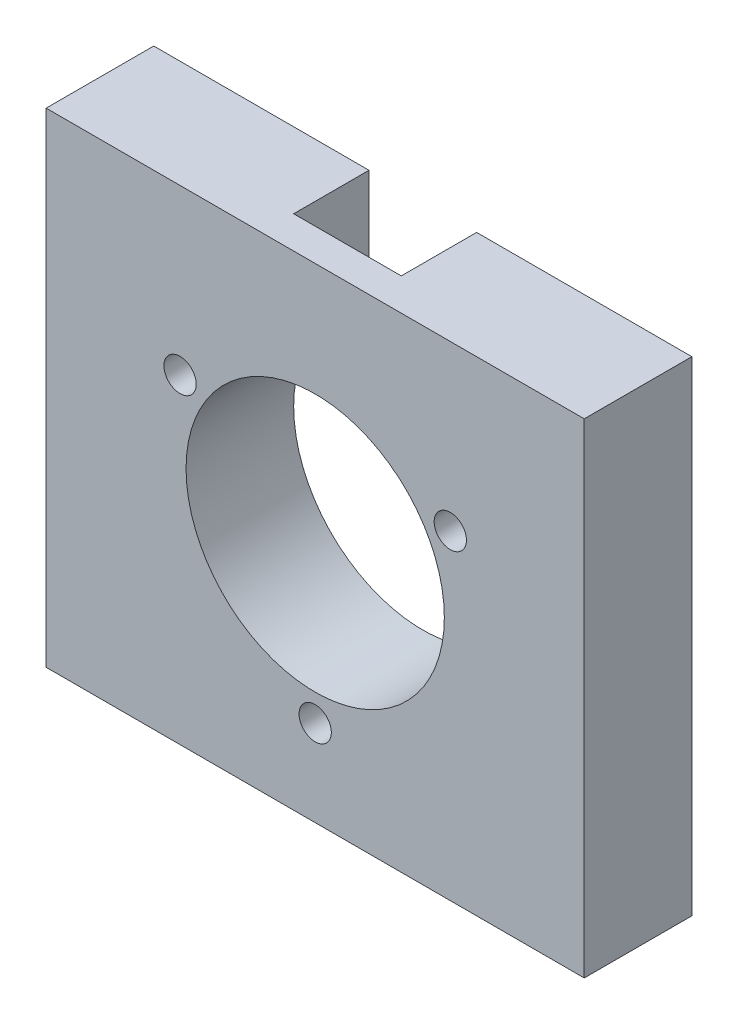
ISO-10303-21;
HEADER;
FILE_DESCRIPTION(('STEP AP214'),'2;1');
FILE_NAME('part.step','',(''),(''),'','','');
FILE_SCHEMA(('AUTOMOTIVE_DESIGN { 1 0 10303 214 1 1 1 1 }'));
ENDSEC;
DATA;
#1=APPLICATION_CONTEXT('core data for automotive mechanical design processes');
#2=APPLICATION_PROTOCOL_DEFINITION('international standard','automotive_design',2000,#1);
#3=PRODUCT_CONTEXT('',#1,'mechanical');
#4=PRODUCT('Part','Part','',(#3));
#5=PRODUCT_RELATED_PRODUCT_CATEGORY('part','',(#4));
#6=PRODUCT_DEFINITION_FORMATION('','',#4);
#7=PRODUCT_DEFINITION_CONTEXT('part definition',#1,'design');
#8=PRODUCT_DEFINITION('design','',#6,#7);
#9=PRODUCT_DEFINITION_SHAPE('','',#8);
#10=(LENGTH_UNIT() NAMED_UNIT(*) SI_UNIT(.MILLI.,.METRE.));
#11=(NAMED_UNIT(*) PLANE_ANGLE_UNIT() SI_UNIT($,.RADIAN.));
#12=(NAMED_UNIT(*) SI_UNIT($,.STERADIAN.) SOLID_ANGLE_UNIT());
#13=UNCERTAINTY_MEASURE_WITH_UNIT(LENGTH_MEASURE(1.E-05),#10,'distance_accuracy_value','');
#14=(GEOMETRIC_REPRESENTATION_CONTEXT(3) GLOBAL_UNCERTAINTY_ASSIGNED_CONTEXT((#13)) GLOBAL_UNIT_ASSIGNED_CONTEXT((#10,
#11,#12)) REPRESENTATION_CONTEXT('',''));
#15=CARTESIAN_POINT('',(0.,0.,0.));
#16=DIRECTION('',(0.,0.,1.));
#17=DIRECTION('',(1.,0.,0.));
#18=AXIS2_PLACEMENT_3D('',#15,#16,#17);
#19=CARTESIAN_POINT('',(0.,45.,0.));
#20=DIRECTION('',(0.,0.,1.));
#21=DIRECTION('',(1.,0.,0.));
#22=AXIS2_PLACEMENT_3D('',#19,#20,#21);
#23=PLANE('',#22);
#24=CARTESIAN_POINT('',(12.445,29.7486326296758,0.));
#25=DIRECTION('',(0.,0.,1.));
#26=DIRECTION('',(1.,0.,0.));
#27=AXIS2_PLACEMENT_3D('',#24,#25,#26);
#28=CIRCLE('',#27,1.5);
#29=CARTESIAN_POINT('',(13.945,29.7486326296758,0.));
#30=VERTEX_POINT('',#29);
#31=EDGE_CURVE('E149',#30,#30,#28,.T.);
#32=ORIENTED_EDGE('',*,*,#31,.T.);
#33=EDGE_LOOP('',(#32));
#34=FACE_BOUND('',#33,.T.);
#35=CARTESIAN_POINT('',(37.555,29.7486326296758,0.));
#36=DIRECTION('',(0.,0.,1.));
#37=DIRECTION('',(1.,0.,0.));
#38=AXIS2_PLACEMENT_3D('',#35,#36,#37);
#39=CIRCLE('',#38,1.5);
#40=CARTESIAN_POINT('',(39.055,29.7486326296758,0.));
#41=VERTEX_POINT('',#40);
#42=EDGE_CURVE('E145',#41,#41,#39,.T.);
#43=ORIENTED_EDGE('',*,*,#42,.T.);
#44=EDGE_LOOP('',(#43));
#45=FACE_BOUND('',#44,.T.);
#46=CARTESIAN_POINT('',(25.,8.0027347406485,0.));
#47=DIRECTION('',(0.,0.,1.));
#48=DIRECTION('',(1.,0.,0.));
#49=AXIS2_PLACEMENT_3D('',#46,#47,#48);
#50=CIRCLE('',#49,1.5);
#51=CARTESIAN_POINT('',(26.5,8.0027347406485,0.));
#52=VERTEX_POINT('',#51);
#53=EDGE_CURVE('E37',#52,#52,#50,.T.);
#54=ORIENTED_EDGE('',*,*,#53,.T.);
#55=EDGE_LOOP('',(#54));
#56=FACE_BOUND('',#55,.T.);
#57=DIRECTION('',(0.,1.,0.));
#58=VECTOR('',#57,1.);
#59=CARTESIAN_POINT('',(30.,33.4087121146357,0.));
#60=LINE('',#59,#58);
#61=CARTESIAN_POINT('',(30.,33.4087121146357,0.));
#62=VERTEX_POINT('',#61);
#63=CARTESIAN_POINT('',(30.,45.,0.));
#64=VERTEX_POINT('',#63);
#65=EDGE_CURVE('E176',#62,#64,#60,.T.);
#66=ORIENTED_EDGE('',*,*,#65,.T.);
#67=DIRECTION('',(-1.,0.,0.));
#68=VECTOR('',#67,1.);
#69=CARTESIAN_POINT('',(0.,45.,0.));
#70=LINE('',#69,#68);
#71=CARTESIAN_POINT('',(50.,45.,0.));
#72=VERTEX_POINT('',#71);
#73=EDGE_CURVE('E127',#72,#64,#70,.T.);
#74=ORIENTED_EDGE('',*,*,#73,.F.);
#75=DIRECTION('',(0.,-1.,0.));
#76=VECTOR('',#75,1.);
#77=CARTESIAN_POINT('',(50.,45.,0.));
#78=LINE('',#77,#76);
#79=CARTESIAN_POINT('',(50.,0.,0.));
#80=VERTEX_POINT('',#79);
#81=EDGE_CURVE('E166',#72,#80,#78,.T.);
#82=ORIENTED_EDGE('',*,*,#81,.T.);
#83=DIRECTION('',(-1.,0.,0.));
#84=VECTOR('',#83,1.);
#85=CARTESIAN_POINT('',(0.,0.,0.));
#86=LINE('',#85,#84);
#87=CARTESIAN_POINT('',(0.,0.,0.));
#88=VERTEX_POINT('',#87);
#89=EDGE_CURVE('E81',#80,#88,#86,.T.);
#90=ORIENTED_EDGE('',*,*,#89,.T.);
#91=DIRECTION('',(0.,-1.,0.));
#92=VECTOR('',#91,1.);
#93=CARTESIAN_POINT('',(0.,45.,0.));
#94=LINE('',#93,#92);
#95=CARTESIAN_POINT('',(0.,45.,0.));
#96=VERTEX_POINT('',#95);
#97=EDGE_CURVE('E156',#96,#88,#94,.T.);
#98=ORIENTED_EDGE('',*,*,#97,.F.);
#99=CARTESIAN_POINT('',(20.,45.,0.));
#100=VERTEX_POINT('',#99);
#101=EDGE_CURVE('E59',#100,#96,#70,.T.);
#102=ORIENTED_EDGE('',*,*,#101,.F.);
#103=DIRECTION('',(0.,-1.,0.));
#104=VECTOR('',#103,1.);
#105=CARTESIAN_POINT('',(20.,33.4087121146357,0.));
#106=LINE('',#105,#104);
#107=CARTESIAN_POINT('',(20.,33.4087121146357,0.));
#108=VERTEX_POINT('',#107);
#109=EDGE_CURVE('E177',#100,#108,#106,.T.);
#110=ORIENTED_EDGE('',*,*,#109,.T.);
#111=CARTESIAN_POINT('',(25.,22.5,0.));
#112=DIRECTION('',(0.,0.,1.));
#113=DIRECTION('',(1.,0.,0.));
#114=AXIS2_PLACEMENT_3D('',#111,#112,#113);
#115=CIRCLE('',#114,12.);
#116=EDGE_CURVE('E141',#108,#62,#115,.T.);
#117=ORIENTED_EDGE('',*,*,#116,.T.);
#118=EDGE_LOOP('',(#66,#74,#82,#90,#98,#102,#110,#117));
#119=FACE_BOUND('',#118,.T.);
#120=ADVANCED_FACE('F33',(#34,#45,#56,#119),#23,.F.);
#121=CARTESIAN_POINT('',(0.,45.,10.));
#122=DIRECTION('',(0.,-1.,0.));
#123=DIRECTION('',(0.,0.,-1.));
#124=AXIS2_PLACEMENT_3D('',#121,#122,#123);
#125=PLANE('',#124);
#126=DIRECTION('',(0.,0.,-1.));
#127=VECTOR('',#126,1.);
#128=CARTESIAN_POINT('',(30.,45.,7.));
#129=LINE('',#128,#127);
#130=CARTESIAN_POINT('',(30.,45.,7.));
#131=VERTEX_POINT('',#130);
#132=EDGE_CURVE('E111',#131,#64,#129,.T.);
#133=ORIENTED_EDGE('',*,*,#132,.F.);
#134=DIRECTION('',(-1.,0.,0.));
#135=VECTOR('',#134,1.);
#136=CARTESIAN_POINT('',(20.,45.,7.));
#137=LINE('',#136,#135);
#138=CARTESIAN_POINT('',(20.,45.,7.));
#139=VERTEX_POINT('',#138);
#140=EDGE_CURVE('E116',#131,#139,#137,.T.);
#141=ORIENTED_EDGE('',*,*,#140,.T.);
#142=DIRECTION('',(0.,0.,-1.));
#143=VECTOR('',#142,1.);
#144=CARTESIAN_POINT('',(20.,45.,7.));
#145=LINE('',#144,#143);
#146=EDGE_CURVE('E128',#139,#100,#145,.T.);
#147=ORIENTED_EDGE('',*,*,#146,.T.);
#148=ORIENTED_EDGE('',*,*,#101,.T.);
#149=DIRECTION('',(0.,0.,1.));
#150=VECTOR('',#149,1.);
#151=CARTESIAN_POINT('',(0.,45.,0.));
#152=LINE('',#151,#150);
#153=CARTESIAN_POINT('',(0.,45.,10.));
#154=VERTEX_POINT('',#153);
#155=EDGE_CURVE('E150',#96,#154,#152,.T.);
#156=ORIENTED_EDGE('',*,*,#155,.T.);
#157=DIRECTION('',(1.,0.,0.));
#158=VECTOR('',#157,1.);
#159=CARTESIAN_POINT('',(50.,45.,10.));
#160=LINE('',#159,#158);
#161=CARTESIAN_POINT('',(50.,45.,10.));
#162=VERTEX_POINT('',#161);
#163=EDGE_CURVE('E88',#154,#162,#160,.T.);
#164=ORIENTED_EDGE('',*,*,#163,.T.);
#165=DIRECTION('',(0.,0.,-1.));
#166=VECTOR('',#165,1.);
#167=CARTESIAN_POINT('',(50.,45.,0.));
#168=LINE('',#167,#166);
#169=EDGE_CURVE('E153',#162,#72,#168,.T.);
#170=ORIENTED_EDGE('',*,*,#169,.T.);
#171=ORIENTED_EDGE('',*,*,#73,.T.);
#172=EDGE_LOOP('',(#133,#141,#147,#148,#156,#164,#170,#171));
#173=FACE_BOUND('',#172,.T.);
#174=ADVANCED_FACE('F125',(#173),#125,.F.);
#175=CARTESIAN_POINT('',(25.,22.5,-35.));
#176=DIRECTION('',(0.,0.,1.));
#177=DIRECTION('',(1.,0.,0.));
#178=AXIS2_PLACEMENT_3D('',#175,#176,#177);
#179=CYLINDRICAL_SURFACE('',#178,12.);
#180=CARTESIAN_POINT('',(25.,22.5,10.));
#181=DIRECTION('',(0.,0.,1.));
#182=DIRECTION('',(1.,0.,0.));
#183=AXIS2_PLACEMENT_3D('',#180,#181,#182);
#184=CIRCLE('',#183,12.);
#185=CARTESIAN_POINT('',(37.,22.5,10.));
#186=VERTEX_POINT('',#185);
#187=EDGE_CURVE('E138',#186,#186,#184,.T.);
#188=ORIENTED_EDGE('',*,*,#187,.T.);
#189=EDGE_LOOP('',(#188));
#190=FACE_BOUND('',#189,.T.);
#191=DIRECTION('',(0.,0.,-1.));
#192=VECTOR('',#191,1.);
#193=CARTESIAN_POINT('',(30.,33.4087121146357,7.));
#194=LINE('',#193,#192);
#195=CARTESIAN_POINT('',(30.,33.4087121146357,7.));
#196=VERTEX_POINT('',#195);
#197=EDGE_CURVE('E50',#196,#62,#194,.T.);
#198=ORIENTED_EDGE('',*,*,#197,.T.);
#199=ORIENTED_EDGE('',*,*,#116,.F.);
#200=DIRECTION('',(0.,0.,-1.));
#201=VECTOR('',#200,1.);
#202=CARTESIAN_POINT('',(20.,33.4087121146357,7.));
#203=LINE('',#202,#201);
#204=CARTESIAN_POINT('',(20.,33.4087121146357,7.));
#205=VERTEX_POINT('',#204);
#206=EDGE_CURVE('E132',#205,#108,#203,.T.);
#207=ORIENTED_EDGE('',*,*,#206,.F.);
#208=CARTESIAN_POINT('',(25.,22.5,7.));
#209=DIRECTION('',(0.,0.,-1.));
#210=DIRECTION('',(1.,0.,0.));
#211=AXIS2_PLACEMENT_3D('',#208,#209,#210);
#212=CIRCLE('',#211,12.);
#213=EDGE_CURVE('E117',#205,#196,#212,.T.);
#214=ORIENTED_EDGE('',*,*,#213,.T.);
#215=EDGE_LOOP('',(#198,#199,#207,#214));
#216=FACE_BOUND('',#215,.T.);
#217=ADVANCED_FACE('F180',(#190,#216),#179,.F.);
#218=CARTESIAN_POINT('',(0.,45.,0.));
#219=DIRECTION('',(1.,0.,0.));
#220=DIRECTION('',(0.,0.,-1.));
#221=AXIS2_PLACEMENT_3D('',#218,#219,#220);
#222=PLANE('',#221);
#223=DIRECTION('',(0.,0.,1.));
#224=VECTOR('',#223,1.);
#225=CARTESIAN_POINT('',(0.,0.,0.));
#226=LINE('',#225,#224);
#227=CARTESIAN_POINT('',(0.,0.,10.));
#228=VERTEX_POINT('',#227);
#229=EDGE_CURVE('E157',#88,#228,#226,.T.);
#230=ORIENTED_EDGE('',*,*,#229,.T.);
#231=DIRECTION('',(0.,-1.,0.));
#232=VECTOR('',#231,1.);
#233=CARTESIAN_POINT('',(0.,45.,10.));
#234=LINE('',#233,#232);
#235=EDGE_CURVE('E11',#154,#228,#234,.T.);
#236=ORIENTED_EDGE('',*,*,#235,.F.);
#237=ORIENTED_EDGE('',*,*,#155,.F.);
#238=ORIENTED_EDGE('',*,*,#97,.T.);
#239=EDGE_LOOP('',(#230,#236,#237,#238));
#240=FACE_BOUND('',#239,.T.);
#241=ADVANCED_FACE('F35',(#240),#222,.F.);
#242=CARTESIAN_POINT('',(50.,45.,10.));
#243=DIRECTION('',(0.,0.,-1.));
#244=DIRECTION('',(-1.,0.,0.));
#245=AXIS2_PLACEMENT_3D('',#242,#243,#244);
#246=PLANE('',#245);
#247=CARTESIAN_POINT('',(25.,8.0027347406485,10.));
#248=DIRECTION('',(0.,0.,1.));
#249=DIRECTION('',(1.,0.,0.));
#250=AXIS2_PLACEMENT_3D('',#247,#248,#249);
#251=CIRCLE('',#250,1.5);
#252=CARTESIAN_POINT('',(26.5,8.0027347406485,10.));
#253=VERTEX_POINT('',#252);
#254=EDGE_CURVE('E130',#253,#253,#251,.T.);
#255=ORIENTED_EDGE('',*,*,#254,.F.);
#256=EDGE_LOOP('',(#255));
#257=FACE_BOUND('',#256,.T.);
#258=ORIENTED_EDGE('',*,*,#187,.F.);
#259=EDGE_LOOP('',(#258));
#260=FACE_BOUND('',#259,.T.);
#261=CARTESIAN_POINT('',(37.555,29.7486326296758,10.));
#262=DIRECTION('',(0.,0.,1.));
#263=DIRECTION('',(1.,0.,0.));
#264=AXIS2_PLACEMENT_3D('',#261,#262,#263);
#265=CIRCLE('',#264,1.5);
#266=CARTESIAN_POINT('',(39.055,29.7486326296758,10.));
#267=VERTEX_POINT('',#266);
#268=EDGE_CURVE('E142',#267,#267,#265,.T.);
#269=ORIENTED_EDGE('',*,*,#268,.F.);
#270=EDGE_LOOP('',(#269));
#271=FACE_BOUND('',#270,.T.);
#272=CARTESIAN_POINT('',(12.445,29.7486326296758,10.));
#273=DIRECTION('',(0.,0.,1.));
#274=DIRECTION('',(1.,0.,0.));
#275=AXIS2_PLACEMENT_3D('',#272,#273,#274);
#276=CIRCLE('',#275,1.5);
#277=CARTESIAN_POINT('',(13.945,29.7486326296758,10.));
#278=VERTEX_POINT('',#277);
#279=EDGE_CURVE('E146',#278,#278,#276,.T.);
#280=ORIENTED_EDGE('',*,*,#279,.F.);
#281=EDGE_LOOP('',(#280));
#282=FACE_BOUND('',#281,.T.);
#283=DIRECTION('',(1.,0.,0.));
#284=VECTOR('',#283,1.);
#285=CARTESIAN_POINT('',(50.,0.,10.));
#286=LINE('',#285,#284);
#287=CARTESIAN_POINT('',(50.,0.,10.));
#288=VERTEX_POINT('',#287);
#289=EDGE_CURVE('E160',#228,#288,#286,.T.);
#290=ORIENTED_EDGE('',*,*,#289,.T.);
#291=DIRECTION('',(0.,-1.,0.));
#292=VECTOR('',#291,1.);
#293=CARTESIAN_POINT('',(50.,45.,10.));
#294=LINE('',#293,#292);
#295=EDGE_CURVE('E42',#162,#288,#294,.T.);
#296=ORIENTED_EDGE('',*,*,#295,.F.);
#297=ORIENTED_EDGE('',*,*,#163,.F.);
#298=ORIENTED_EDGE('',*,*,#235,.T.);
#299=EDGE_LOOP('',(#290,#296,#297,#298));
#300=FACE_BOUND('',#299,.T.);
#301=ADVANCED_FACE('F193',(#257,#260,#271,#282,#300),#246,.F.);
#302=CARTESIAN_POINT('',(50.,45.,0.));
#303=DIRECTION('',(-1.,0.,0.));
#304=DIRECTION('',(0.,0.,1.));
#305=AXIS2_PLACEMENT_3D('',#302,#303,#304);
#306=PLANE('',#305);
#307=DIRECTION('',(0.,0.,-1.));
#308=VECTOR('',#307,1.);
#309=CARTESIAN_POINT('',(50.,0.,0.));
#310=LINE('',#309,#308);
#311=EDGE_CURVE('E162',#288,#80,#310,.T.);
#312=ORIENTED_EDGE('',*,*,#311,.T.);
#313=ORIENTED_EDGE('',*,*,#81,.F.);
#314=ORIENTED_EDGE('',*,*,#169,.F.);
#315=ORIENTED_EDGE('',*,*,#295,.T.);
#316=EDGE_LOOP('',(#312,#313,#314,#315));
#317=FACE_BOUND('',#316,.T.);
#318=ADVANCED_FACE('F196',(#317),#306,.F.);
#319=CARTESIAN_POINT('',(0.,0.,10.));
#320=DIRECTION('',(0.,-1.,0.));
#321=DIRECTION('',(0.,0.,-1.));
#322=AXIS2_PLACEMENT_3D('',#319,#320,#321);
#323=PLANE('',#322);
#324=ORIENTED_EDGE('',*,*,#229,.F.);
#325=ORIENTED_EDGE('',*,*,#89,.F.);
#326=ORIENTED_EDGE('',*,*,#311,.F.);
#327=ORIENTED_EDGE('',*,*,#289,.F.);
#328=EDGE_LOOP('',(#324,#325,#326,#327));
#329=FACE_BOUND('',#328,.T.);
#330=ADVANCED_FACE('F198',(#329),#323,.T.);
#331=CARTESIAN_POINT('',(12.445,29.7486326296758,-35.));
#332=DIRECTION('',(0.,0.,1.));
#333=DIRECTION('',(1.,0.,0.));
#334=AXIS2_PLACEMENT_3D('',#331,#332,#333);
#335=CYLINDRICAL_SURFACE('',#334,1.5);
#336=ORIENTED_EDGE('',*,*,#279,.T.);
#337=EDGE_LOOP('',(#336));
#338=FACE_BOUND('',#337,.T.);
#339=ORIENTED_EDGE('',*,*,#31,.F.);
#340=EDGE_LOOP('',(#339));
#341=FACE_BOUND('',#340,.T.);
#342=ADVANCED_FACE('F200',(#338,#341),#335,.F.);
#343=CARTESIAN_POINT('',(37.555,29.7486326296758,-35.));
#344=DIRECTION('',(0.,0.,1.));
#345=DIRECTION('',(1.,0.,0.));
#346=AXIS2_PLACEMENT_3D('',#343,#344,#345);
#347=CYLINDRICAL_SURFACE('',#346,1.5);
#348=ORIENTED_EDGE('',*,*,#268,.T.);
#349=EDGE_LOOP('',(#348));
#350=FACE_BOUND('',#349,.T.);
#351=ORIENTED_EDGE('',*,*,#42,.F.);
#352=EDGE_LOOP('',(#351));
#353=FACE_BOUND('',#352,.T.);
#354=ADVANCED_FACE('F206',(#350,#353),#347,.F.);
#355=CARTESIAN_POINT('',(25.,8.0027347406485,-35.));
#356=DIRECTION('',(0.,0.,1.));
#357=DIRECTION('',(1.,0.,0.));
#358=AXIS2_PLACEMENT_3D('',#355,#356,#357);
#359=CYLINDRICAL_SURFACE('',#358,1.5);
#360=ORIENTED_EDGE('',*,*,#254,.T.);
#361=EDGE_LOOP('',(#360));
#362=FACE_BOUND('',#361,.T.);
#363=ORIENTED_EDGE('',*,*,#53,.F.);
#364=EDGE_LOOP('',(#363));
#365=FACE_BOUND('',#364,.T.);
#366=ADVANCED_FACE('F235',(#362,#365),#359,.F.);
#367=CARTESIAN_POINT('',(30.,33.4087121146357,7.));
#368=DIRECTION('',(-1.,0.,0.));
#369=DIRECTION('',(0.,0.,1.));
#370=AXIS2_PLACEMENT_3D('',#367,#368,#369);
#371=PLANE('',#370);
#372=ORIENTED_EDGE('',*,*,#65,.F.);
#373=ORIENTED_EDGE('',*,*,#197,.F.);
#374=DIRECTION('',(0.,1.,0.));
#375=VECTOR('',#374,1.);
#376=CARTESIAN_POINT('',(30.,33.4087121146357,7.));
#377=LINE('',#376,#375);
#378=EDGE_CURVE('E107',#196,#131,#377,.T.);
#379=ORIENTED_EDGE('',*,*,#378,.T.);
#380=ORIENTED_EDGE('',*,*,#132,.T.);
#381=EDGE_LOOP('',(#372,#373,#379,#380));
#382=FACE_BOUND('',#381,.T.);
#383=ADVANCED_FACE('F109',(#382),#371,.T.);
#384=CARTESIAN_POINT('',(20.,33.4087121146357,7.));
#385=DIRECTION('',(1.,0.,0.));
#386=DIRECTION('',(0.,0.,-1.));
#387=AXIS2_PLACEMENT_3D('',#384,#385,#386);
#388=PLANE('',#387);
#389=ORIENTED_EDGE('',*,*,#109,.F.);
#390=ORIENTED_EDGE('',*,*,#146,.F.);
#391=DIRECTION('',(0.,-1.,0.));
#392=VECTOR('',#391,1.);
#393=CARTESIAN_POINT('',(20.,33.4087121146357,7.));
#394=LINE('',#393,#392);
#395=EDGE_CURVE('E122',#139,#205,#394,.T.);
#396=ORIENTED_EDGE('',*,*,#395,.T.);
#397=ORIENTED_EDGE('',*,*,#206,.T.);
#398=EDGE_LOOP('',(#389,#390,#396,#397));
#399=FACE_BOUND('',#398,.T.);
#400=ADVANCED_FACE('F186',(#399),#388,.T.);
#401=CARTESIAN_POINT('',(25.,22.5,7.));
#402=DIRECTION('',(0.,0.,1.));
#403=DIRECTION('',(1.,0.,0.));
#404=AXIS2_PLACEMENT_3D('',#401,#402,#403);
#405=PLANE('',#404);
#406=ORIENTED_EDGE('',*,*,#213,.F.);
#407=ORIENTED_EDGE('',*,*,#395,.F.);
#408=ORIENTED_EDGE('',*,*,#140,.F.);
#409=ORIENTED_EDGE('',*,*,#378,.F.);
#410=EDGE_LOOP('',(#406,#407,#408,#409));
#411=FACE_BOUND('',#410,.T.);
#412=ADVANCED_FACE('F121',(#411),#405,.F.);
#413=CLOSED_SHELL('',(#120,#174,#217,#241,#301,#318,#330,#342,#354,#366,#383,#400,#412));
#414=MANIFOLD_SOLID_BREP('B2',#413);
#415=ADVANCED_BREP_SHAPE_REPRESENTATION('',(#18,#414),#14);
#416=SHAPE_DEFINITION_REPRESENTATION(#9,#415);
ENDSEC;
END-ISO-10303-21;
